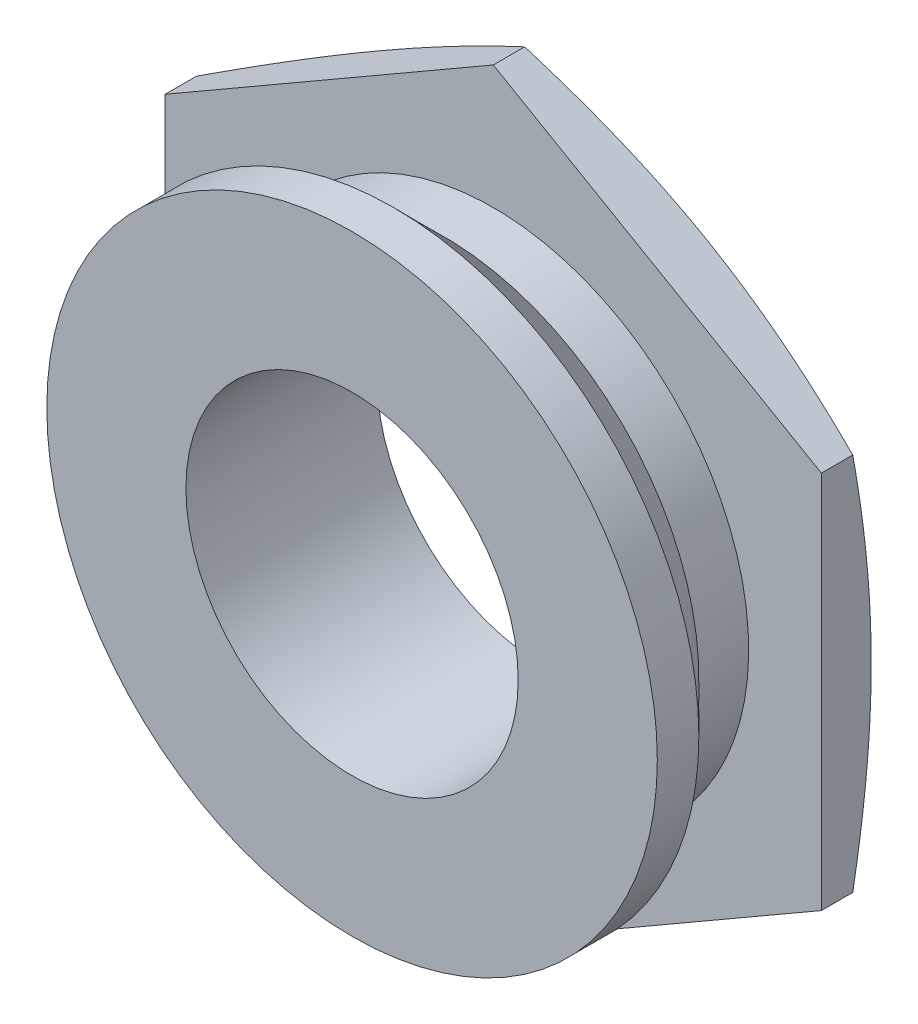
ISO-10303-21;
HEADER;
FILE_DESCRIPTION(('STEP AP214'),'2;1');
FILE_NAME('part.step','',(''),(''),'','','');
FILE_SCHEMA(('AUTOMOTIVE_DESIGN { 1 0 10303 214 1 1 1 1 }'));
ENDSEC;
DATA;
#1=APPLICATION_CONTEXT('core data for automotive mechanical design processes');
#2=APPLICATION_PROTOCOL_DEFINITION('international standard','automotive_design',2000,#1);
#3=PRODUCT_CONTEXT('',#1,'mechanical');
#4=PRODUCT('Part','Part','',(#3));
#5=PRODUCT_RELATED_PRODUCT_CATEGORY('part','',(#4));
#6=PRODUCT_DEFINITION_FORMATION('','',#4);
#7=PRODUCT_DEFINITION_CONTEXT('part definition',#1,'design');
#8=PRODUCT_DEFINITION('design','',#6,#7);
#9=PRODUCT_DEFINITION_SHAPE('','',#8);
#10=(LENGTH_UNIT() NAMED_UNIT(*) SI_UNIT(.MILLI.,.METRE.));
#11=(NAMED_UNIT(*) PLANE_ANGLE_UNIT() SI_UNIT($,.RADIAN.));
#12=(NAMED_UNIT(*) SI_UNIT($,.STERADIAN.) SOLID_ANGLE_UNIT());
#13=UNCERTAINTY_MEASURE_WITH_UNIT(LENGTH_MEASURE(1.E-05),#10,'distance_accuracy_value','');
#14=(GEOMETRIC_REPRESENTATION_CONTEXT(3) GLOBAL_UNCERTAINTY_ASSIGNED_CONTEXT((#13)) GLOBAL_UNIT_ASSIGNED_CONTEXT((#10,
#11,#12)) REPRESENTATION_CONTEXT('',''));
#15=CARTESIAN_POINT('',(0.,0.,0.));
#16=DIRECTION('',(0.,0.,1.));
#17=DIRECTION('',(1.,0.,0.));
#18=AXIS2_PLACEMENT_3D('',#15,#16,#17);
#19=CARTESIAN_POINT('',(0.,3.075,0.));
#20=DIRECTION('',(0.,0.,1.));
#21=DIRECTION('',(0.,-1.,0.));
#22=AXIS2_PLACEMENT_3D('',#19,#20,#21);
#23=PLANE('',#22);
#24=DIRECTION('',(-0.866025403784439,-0.5,0.));
#25=VECTOR('',#24,1.);
#26=CARTESIAN_POINT('',(3.95,-2.28053356329902,0.));
#27=LINE('',#26,#25);
#28=CARTESIAN_POINT('',(3.95,-2.28053356329902,0.));
#29=VERTEX_POINT('',#28);
#30=CARTESIAN_POINT('',(0.,-4.56106712659804,0.));
#31=VERTEX_POINT('',#30);
#32=EDGE_CURVE('E145',#29,#31,#27,.T.);
#33=ORIENTED_EDGE('',*,*,#32,.F.);
#34=DIRECTION('',(0.,-1.,0.));
#35=VECTOR('',#34,1.);
#36=CARTESIAN_POINT('',(3.95,2.28053356329902,0.));
#37=LINE('',#36,#35);
#38=CARTESIAN_POINT('',(3.95,2.28053356329902,0.));
#39=VERTEX_POINT('',#38);
#40=EDGE_CURVE('E137',#39,#29,#37,.T.);
#41=ORIENTED_EDGE('',*,*,#40,.F.);
#42=DIRECTION('',(0.866025403784439,-0.5,0.));
#43=VECTOR('',#42,1.);
#44=CARTESIAN_POINT('',(0.,4.56106712659804,0.));
#45=LINE('',#44,#43);
#46=CARTESIAN_POINT('',(0.,4.56106712659804,0.));
#47=VERTEX_POINT('',#46);
#48=EDGE_CURVE('E152',#47,#39,#45,.T.);
#49=ORIENTED_EDGE('',*,*,#48,.F.);
#50=DIRECTION('',(0.866025403784439,0.5,0.));
#51=VECTOR('',#50,1.);
#52=CARTESIAN_POINT('',(-3.95,2.28053356329902,0.));
#53=LINE('',#52,#51);
#54=CARTESIAN_POINT('',(-3.95,2.28053356329902,0.));
#55=VERTEX_POINT('',#54);
#56=EDGE_CURVE('E129',#55,#47,#53,.T.);
#57=ORIENTED_EDGE('',*,*,#56,.F.);
#58=DIRECTION('',(0.,1.,0.));
#59=VECTOR('',#58,1.);
#60=CARTESIAN_POINT('',(-3.95,-2.28053356329902,0.));
#61=LINE('',#60,#59);
#62=CARTESIAN_POINT('',(-3.95,-2.28053356329902,0.));
#63=VERTEX_POINT('',#62);
#64=EDGE_CURVE('E128',#63,#55,#61,.T.);
#65=ORIENTED_EDGE('',*,*,#64,.F.);
#66=DIRECTION('',(-0.866025403784439,0.5,0.));
#67=VECTOR('',#66,1.);
#68=CARTESIAN_POINT('',(0.,-4.56106712659804,0.));
#69=LINE('',#68,#67);
#70=EDGE_CURVE('E141',#31,#63,#69,.T.);
#71=ORIENTED_EDGE('',*,*,#70,.F.);
#72=EDGE_LOOP('',(#33,#41,#49,#57,#65,#71));
#73=FACE_BOUND('',#72,.T.);
#74=CARTESIAN_POINT('',(0.,0.,0.));
#75=DIRECTION('',(0.,0.,1.));
#76=DIRECTION('',(0.,-1.,0.));
#77=AXIS2_PLACEMENT_3D('',#74,#75,#76);
#78=CIRCLE('',#77,3.075);
#79=CARTESIAN_POINT('',(0.,-3.075,0.));
#80=VERTEX_POINT('',#79);
#81=EDGE_CURVE('E162',#80,#80,#78,.T.);
#82=ORIENTED_EDGE('',*,*,#81,.F.);
#83=EDGE_LOOP('',(#82));
#84=FACE_BOUND('',#83,.T.);
#85=ADVANCED_FACE('F35',(#73,#84),#23,.T.);
#86=CARTESIAN_POINT('',(0.,0.,1.7));
#87=DIRECTION('',(0.,0.,1.));
#88=DIRECTION('',(0.,-1.,0.));
#89=AXIS2_PLACEMENT_3D('',#86,#87,#88);
#90=CYLINDRICAL_SURFACE('',#89,3.075);
#91=ORIENTED_EDGE('',*,*,#81,.T.);
#92=EDGE_LOOP('',(#91));
#93=FACE_BOUND('',#92,.T.);
#94=CARTESIAN_POINT('',(0.,0.,0.600000000000001));
#95=DIRECTION('',(0.,0.,1.));
#96=DIRECTION('',(0.,-1.,0.));
#97=AXIS2_PLACEMENT_3D('',#94,#95,#96);
#98=CIRCLE('',#97,3.075);
#99=CARTESIAN_POINT('',(0.,-3.075,0.600000000000001));
#100=VERTEX_POINT('',#99);
#101=EDGE_CURVE('E160',#100,#100,#98,.T.);
#102=ORIENTED_EDGE('',*,*,#101,.F.);
#103=EDGE_LOOP('',(#102));
#104=FACE_BOUND('',#103,.T.);
#105=ADVANCED_FACE('F248',(#93,#104),#90,.T.);
#106=CARTESIAN_POINT('',(0.,0.,1.2));
#107=DIRECTION('',(0.,0.,1.));
#108=DIRECTION('',(0.,-1.,0.));
#109=AXIS2_PLACEMENT_3D('',#106,#107,#108);
#110=CONICAL_SURFACE('',#109,3.675,0.785398163397448);
#111=ORIENTED_EDGE('',*,*,#101,.T.);
#112=EDGE_LOOP('',(#111));
#113=FACE_BOUND('',#112,.T.);
#114=CARTESIAN_POINT('',(0.,0.,1.2));
#115=DIRECTION('',(0.,0.,1.));
#116=DIRECTION('',(0.,-1.,0.));
#117=AXIS2_PLACEMENT_3D('',#114,#115,#116);
#118=CIRCLE('',#117,3.675);
#119=CARTESIAN_POINT('',(0.,-3.675,1.2));
#120=VERTEX_POINT('',#119);
#121=EDGE_CURVE('E157',#120,#120,#118,.T.);
#122=ORIENTED_EDGE('',*,*,#121,.F.);
#123=EDGE_LOOP('',(#122));
#124=FACE_BOUND('',#123,.T.);
#125=ADVANCED_FACE('F253',(#113,#124),#110,.T.);
#126=CARTESIAN_POINT('',(0.,0.,1.7));
#127=DIRECTION('',(0.,0.,1.));
#128=DIRECTION('',(0.,-1.,0.));
#129=AXIS2_PLACEMENT_3D('',#126,#127,#128);
#130=CYLINDRICAL_SURFACE('',#129,3.675);
#131=ORIENTED_EDGE('',*,*,#121,.T.);
#132=EDGE_LOOP('',(#131));
#133=FACE_BOUND('',#132,.T.);
#134=CARTESIAN_POINT('',(0.,0.,1.7));
#135=DIRECTION('',(0.,0.,1.));
#136=DIRECTION('',(0.,-1.,0.));
#137=AXIS2_PLACEMENT_3D('',#134,#135,#136);
#138=CIRCLE('',#137,3.675);
#139=CARTESIAN_POINT('',(0.,-3.675,1.7));
#140=VERTEX_POINT('',#139);
#141=EDGE_CURVE('E154',#140,#140,#138,.T.);
#142=ORIENTED_EDGE('',*,*,#141,.F.);
#143=EDGE_LOOP('',(#142));
#144=FACE_BOUND('',#143,.T.);
#145=ADVANCED_FACE('F259',(#133,#144),#130,.T.);
#146=CARTESIAN_POINT('',(0.,3.675,1.7));
#147=DIRECTION('',(0.,0.,1.));
#148=DIRECTION('',(0.,-1.,0.));
#149=AXIS2_PLACEMENT_3D('',#146,#147,#148);
#150=PLANE('',#149);
#151=CARTESIAN_POINT('',(0.,0.,1.7));
#152=DIRECTION('',(0.,0.,-1.));
#153=DIRECTION('',(-1.,0.,0.));
#154=AXIS2_PLACEMENT_3D('',#151,#152,#153);
#155=CIRCLE('',#154,2.);
#156=CARTESIAN_POINT('',(-2.,0.,1.7));
#157=VERTEX_POINT('',#156);
#158=EDGE_CURVE('E288',#157,#157,#155,.T.);
#159=ORIENTED_EDGE('',*,*,#158,.T.);
#160=EDGE_LOOP('',(#159));
#161=FACE_BOUND('',#160,.T.);
#162=ORIENTED_EDGE('',*,*,#141,.T.);
#163=EDGE_LOOP('',(#162));
#164=FACE_BOUND('',#163,.T.);
#165=ADVANCED_FACE('F263',(#161,#164),#150,.T.);
#166=CARTESIAN_POINT('',(0.,4.56106712659804,12.0674493300504));
#167=DIRECTION('',(0.5,0.866025403784439,0.));
#168=DIRECTION('',(-0.866025403784439,0.5,0.));
#169=AXIS2_PLACEMENT_3D('',#166,#167,#168);
#170=PLANE('',#169);
#171=CARTESIAN_POINT('',(-0.000200000000000009,4.56118259665188,-0.377547725521246));
#172=CARTESIAN_POINT('',(0.163394645638989,4.46673118395423,-0.411939136315846));
#173=CARTESIAN_POINT('',(0.327528779089733,4.37196829782324,-0.443224156372785));
#174=CARTESIAN_POINT('',(0.656864333361271,4.18182632691085,-0.49826540675319));
#175=CARTESIAN_POINT('',(0.82206648688232,4.08644681910477,-0.522015744883351));
#176=CARTESIAN_POINT('',(1.1517045911922,3.8961301708463,-0.560431271655497));
#177=CARTESIAN_POINT('',(1.31613301273488,3.80119737740621,-0.575180255897328));
#178=CARTESIAN_POINT('',(1.64537440115126,3.61110977317565,-0.594962798298042));
#179=CARTESIAN_POINT('',(1.81018720057563,3.51595505906209,-0.599999999999999));
#180=CARTESIAN_POINT('',(2.13981279942437,3.32564563083498,-0.599999999999999));
#181=CARTESIAN_POINT('',(2.30462559884874,3.23049091672142,-0.594962798298042));
#182=CARTESIAN_POINT('',(2.63386698726512,3.04040331249086,-0.575180255897328));
#183=CARTESIAN_POINT('',(2.7982954088078,2.94547051905077,-0.560431271655497));
#184=CARTESIAN_POINT('',(3.12793351311768,2.7551538707923,-0.522015744883351));
#185=CARTESIAN_POINT('',(3.29313566663873,2.65977436298622,-0.49826540675319));
#186=CARTESIAN_POINT('',(3.62247122091027,2.46963239207383,-0.443224156372785));
#187=CARTESIAN_POINT('',(3.78660535436101,2.37486950594284,-0.411939136315846));
#188=CARTESIAN_POINT('',(3.9502,2.28041809324519,-0.377547725521245));
#189=B_SPLINE_CURVE_WITH_KNOTS('',3,(#171,#172,#173,#174,#175,#176,#177,#178,#179,#180,#181,
#182,#183,#184,#185,#186,#187,#188),.UNSPECIFIED.,.F.,.F.,(4,2,2,2,2,2,2,2,4),(0.,
0.576083228362151,1.15261585512616,1.72369611610119,2.29456208472354,2.86542805334588,
3.43650831432091,4.01304094108492,4.58912416944707),.UNSPECIFIED.);
#190=CARTESIAN_POINT('',(0.,4.56106712659804,-0.377589754779738));
#191=VERTEX_POINT('',#190);
#192=CARTESIAN_POINT('',(1.975,3.42080034494853,-0.599999999999999));
#193=VERTEX_POINT('',#192);
#194=EDGE_CURVE('E279',#191,#193,#189,.T.);
#195=ORIENTED_EDGE('',*,*,#194,.F.);
#196=DIRECTION('',(0.,0.,-1.));
#197=VECTOR('',#196,1.);
#198=CARTESIAN_POINT('',(0.,4.56106712659804,12.0674493300504));
#199=LINE('',#198,#197);
#200=EDGE_CURVE('E131',#47,#191,#199,.T.);
#201=ORIENTED_EDGE('',*,*,#200,.F.);
#202=ORIENTED_EDGE('',*,*,#48,.T.);
#203=DIRECTION('',(0.,0.,-1.));
#204=VECTOR('',#203,1.);
#205=CARTESIAN_POINT('',(3.95,2.28053356329902,12.0674493300504));
#206=LINE('',#205,#204);
#207=CARTESIAN_POINT('',(3.95,2.28053356329903,-0.377589754779738));
#208=VERTEX_POINT('',#207);
#209=EDGE_CURVE('E149',#39,#208,#206,.T.);
#210=ORIENTED_EDGE('',*,*,#209,.T.);
#211=EDGE_CURVE('E273',#193,#208,#189,.T.);
#212=ORIENTED_EDGE('',*,*,#211,.F.);
#213=EDGE_LOOP('',(#195,#201,#202,#210,#212));
#214=FACE_BOUND('',#213,.T.);
#215=ADVANCED_FACE('F267',(#214),#170,.T.);
#216=CARTESIAN_POINT('',(3.95,2.28053356329902,12.0674493300504));
#217=DIRECTION('',(1.,0.,0.));
#218=DIRECTION('',(0.,1.,0.));
#219=AXIS2_PLACEMENT_3D('',#216,#217,#218);
#220=PLANE('',#219);
#221=CARTESIAN_POINT('',(3.95,-6.03805098489355,0.588472147348961));
#222=CARTESIAN_POINT('',(3.95,-5.85933869988011,0.534054324238001));
#223=CARTESIAN_POINT('',(3.95,-5.68042946739473,0.480271486300747));
#224=CARTESIAN_POINT('',(3.95,-5.32211684037161,0.374327053579596));
#225=CARTESIAN_POINT('',(3.95,-5.14271340794712,0.322165587085427));
#226=CARTESIAN_POINT('',(3.95,-4.78300504576268,0.219728399957085));
#227=CARTESIAN_POINT('',(3.95,-4.60269905854142,0.169456379229714));
#228=CARTESIAN_POINT('',(3.95,-4.241416366318,0.0713866322203015));
#229=CARTESIAN_POINT('',(3.95,-4.06043967342107,0.0235888615125296));
#230=CARTESIAN_POINT('',(3.95,-3.6999267765105,-0.0683504780592834));
#231=CARTESIAN_POINT('',(3.95,-3.52040024784364,-0.112529797910796));
#232=CARTESIAN_POINT('',(3.95,-3.16046294750332,-0.197124832577449));
#233=CARTESIAN_POINT('',(3.95,-2.98005220600987,-0.237540674919057));
#234=CARTESIAN_POINT('',(3.95,-2.618292490451,-0.313670032421782));
#235=CARTESIAN_POINT('',(3.95,-2.43694383168832,-0.349385033065053));
#236=CARTESIAN_POINT('',(3.95,-2.07319366031589,-0.41502399378753));
#237=CARTESIAN_POINT('',(3.95,-1.8907921831926,-0.444948147893586));
#238=CARTESIAN_POINT('',(3.95,-1.54547102153879,-0.494827468355308));
#239=CARTESIAN_POINT('',(3.95,-1.38265944413584,-0.515524101436541));
#240=CARTESIAN_POINT('',(3.95,-1.05635681627977,-0.550557384538961));
#241=CARTESIAN_POINT('',(3.95,-0.892865824206534,-0.564894570049616));
#242=CARTESIAN_POINT('',(3.95,-0.565522552709325,-0.586520515381504));
#243=CARTESIAN_POINT('',(3.95,-0.401670595034491,-0.59381406722805));
#244=CARTESIAN_POINT('',(3.95,-0.0738027609892456,-0.600982758327267));
#245=CARTESIAN_POINT('',(3.95,0.0902131142154053,-0.600857949968151));
#246=CARTESIAN_POINT('',(3.95,0.418900194710524,-0.593177383146434));
#247=CARTESIAN_POINT('',(3.95,0.583570504989359,-0.58558394174616));
#248=CARTESIAN_POINT('',(3.95,0.912427289391331,-0.56331515250934));
#249=CARTESIAN_POINT('',(3.95,1.07661375179499,-0.548639634530531));
#250=CARTESIAN_POINT('',(3.95,1.40442251762932,-0.512894731475785));
#251=CARTESIAN_POINT('',(3.95,1.56804421392796,-0.491819854594111));
#252=CARTESIAN_POINT('',(3.95,1.89446683958625,-0.444125383334469));
#253=CARTESIAN_POINT('',(3.95,2.05726776454209,-0.417505759238778));
#254=CARTESIAN_POINT('',(3.95,2.56158688558696,-0.327601137632812));
#255=CARTESIAN_POINT('',(3.95,2.90167554809464,-0.256319814583836));
#256=CARTESIAN_POINT('',(3.95,3.57869455397605,-0.100038633266692));
#257=CARTESIAN_POINT('',(3.95,3.91562371337153,-0.0150338338869124));
#258=CARTESIAN_POINT('',(3.95,4.58748518776409,0.164121164065658));
#259=CARTESIAN_POINT('',(3.95,4.92241435502613,0.258283053367429));
#260=CARTESIAN_POINT('',(3.95,5.59043474624669,0.452664416491018));
#261=CARTESIAN_POINT('',(3.95,5.92352625272211,0.552882929166195));
#262=CARTESIAN_POINT('',(3.95,6.58474397814754,0.756381777672387));
#263=CARTESIAN_POINT('',(3.95,6.91288442125019,0.859616107453526));
#264=CARTESIAN_POINT('',(3.95,7.56824257244402,1.06901711954946));
#265=CARTESIAN_POINT('',(3.95,7.89546023543049,1.17518394255509));
#266=CARTESIAN_POINT('',(3.95,8.54795230850632,1.38924813731862));
#267=CARTESIAN_POINT('',(3.95,8.87322938099829,1.497137414293));
#268=CARTESIAN_POINT('',(3.95,9.52321317990156,1.71453359512624));
#269=CARTESIAN_POINT('',(3.95,9.84791995108263,1.82404036501767));
#270=CARTESIAN_POINT('',(3.95,10.17243201379,1.93411301839285));
#271=B_SPLINE_CURVE_WITH_KNOTS('',3,(#221,#222,#223,#224,#225,#226,#227,#228,#229,#230,#231,
#232,#233,#234,#235,#236,#237,#238,#239,#240,#241,#242,#243,#244,#245,#246,#247,#248,#249,#250,
#251,#252,#253,#254,#255,#256,#257,#258,#259,#260,#261,#262,#263,#264,#265,#266,#267,#268,#269,
#270),.UNSPECIFIED.,.F.,.F.,(4,2,2,2,2,2,2,2,2,2,2,2,2,2,2,2,2,2,2,2,2,2,2,2,4),(0.,
0.560445245275148,1.12093472303445,1.68246993435923,2.2439950596901,2.79861092882412,
3.35320799780336,3.90762938927133,4.46203220119863,4.95428945287775,5.44650524676761,
5.93838593298634,6.43026314556039,6.92463491899961,7.41901856998896,7.91382769631081,
8.40863947468853,9.45056815185454,10.4928728135512,11.5365260910689,12.5800141803173,
13.6119843907916,14.6440041979027,15.6721081678377,16.7001274581947),.UNSPECIFIED.);
#272=CARTESIAN_POINT('',(3.95,0.,-0.599999999999999));
#273=VERTEX_POINT('',#272);
#274=EDGE_CURVE('E280',#208,#273,#271,.F.);
#275=ORIENTED_EDGE('',*,*,#274,.F.);
#276=ORIENTED_EDGE('',*,*,#209,.F.);
#277=ORIENTED_EDGE('',*,*,#40,.T.);
#278=DIRECTION('',(0.,0.,-1.));
#279=VECTOR('',#278,1.);
#280=CARTESIAN_POINT('',(3.95,-2.28053356329902,12.0674493300504));
#281=LINE('',#280,#279);
#282=CARTESIAN_POINT('',(3.95,-2.28053356329902,-0.377589754779738));
#283=VERTEX_POINT('',#282);
#284=EDGE_CURVE('E146',#29,#283,#281,.T.);
#285=ORIENTED_EDGE('',*,*,#284,.T.);
#286=EDGE_CURVE('E192',#273,#283,#271,.F.);
#287=ORIENTED_EDGE('',*,*,#286,.F.);
#288=EDGE_LOOP('',(#275,#276,#277,#285,#287));
#289=FACE_BOUND('',#288,.T.);
#290=ADVANCED_FACE('F246',(#289),#220,.T.);
#291=CARTESIAN_POINT('',(3.95,-2.28053356329902,12.0674493300504));
#292=DIRECTION('',(0.5,-0.866025403784439,0.));
#293=DIRECTION('',(0.866025403784439,0.5,0.));
#294=AXIS2_PLACEMENT_3D('',#291,#292,#293);
#295=PLANE('',#294);
#296=CARTESIAN_POINT('',(3.9502,-2.28041809324518,-0.377547725521246));
#297=CARTESIAN_POINT('',(3.78660535436101,-2.37486950594283,-0.411939136315845));
#298=CARTESIAN_POINT('',(3.62247122091027,-2.46963239207383,-0.443224156372785));
#299=CARTESIAN_POINT('',(3.29313566663873,-2.65977436298621,-0.49826540675319));
#300=CARTESIAN_POINT('',(3.12793351311768,-2.7551538707923,-0.522015744883352));
#301=CARTESIAN_POINT('',(2.7982954088078,-2.94547051905076,-0.560431271655497));
#302=CARTESIAN_POINT('',(2.63386698726512,-3.04040331249086,-0.575180255897328));
#303=CARTESIAN_POINT('',(2.30462559884874,-3.23049091672142,-0.594962798298042));
#304=CARTESIAN_POINT('',(2.13981279942437,-3.32564563083497,-0.6));
#305=CARTESIAN_POINT('',(1.81018720057563,-3.51595505906209,-0.6));
#306=CARTESIAN_POINT('',(1.64537440115126,-3.61110977317564,-0.594962798298043));
#307=CARTESIAN_POINT('',(1.31613301273488,-3.8011973774062,-0.575180255897329));
#308=CARTESIAN_POINT('',(1.1517045911922,-3.8961301708463,-0.560431271655498));
#309=CARTESIAN_POINT('',(0.822066486882319,-4.08644681910476,-0.522015744883352));
#310=CARTESIAN_POINT('',(0.65686433336127,-4.18182632691085,-0.498265406753191));
#311=CARTESIAN_POINT('',(0.327528779089732,-4.37196829782323,-0.443224156372786));
#312=CARTESIAN_POINT('',(0.163394645638988,-4.46673118395423,-0.411939136315846));
#313=CARTESIAN_POINT('',(-0.000200000000000613,-4.56118259665188,-0.377547725521247));
#314=B_SPLINE_CURVE_WITH_KNOTS('',3,(#296,#297,#298,#299,#300,#301,#302,#303,#304,#305,#306,
#307,#308,#309,#310,#311,#312,#313),.UNSPECIFIED.,.F.,.F.,(4,2,2,2,2,2,2,2,4),(0.,
0.576083228362151,1.15261585512617,1.72369611610119,2.29456208472354,2.86542805334588,
3.43650831432091,4.01304094108492,4.58912416944708),.UNSPECIFIED.);
#315=CARTESIAN_POINT('',(1.975,-3.42080034494853,-0.599999999999999));
#316=VERTEX_POINT('',#315);
#317=EDGE_CURVE('E188',#283,#316,#314,.T.);
#318=ORIENTED_EDGE('',*,*,#317,.F.);
#319=ORIENTED_EDGE('',*,*,#284,.F.);
#320=ORIENTED_EDGE('',*,*,#32,.T.);
#321=DIRECTION('',(0.,0.,-1.));
#322=VECTOR('',#321,1.);
#323=CARTESIAN_POINT('',(0.,-4.56106712659804,12.0674493300504));
#324=LINE('',#323,#322);
#325=CARTESIAN_POINT('',(0.,-4.56106712659804,-0.377589754779738));
#326=VERTEX_POINT('',#325);
#327=EDGE_CURVE('E142',#31,#326,#324,.T.);
#328=ORIENTED_EDGE('',*,*,#327,.T.);
#329=EDGE_CURVE('E180',#316,#326,#314,.T.);
#330=ORIENTED_EDGE('',*,*,#329,.F.);
#331=EDGE_LOOP('',(#318,#319,#320,#328,#330));
#332=FACE_BOUND('',#331,.T.);
#333=ADVANCED_FACE('F186',(#332),#295,.T.);
#334=CARTESIAN_POINT('',(0.,-4.56106712659804,12.0674493300504));
#335=DIRECTION('',(-0.5,-0.866025403784438,0.));
#336=DIRECTION('',(0.866025403784439,-0.5,0.));
#337=AXIS2_PLACEMENT_3D('',#334,#335,#336);
#338=PLANE('',#337);
#339=CARTESIAN_POINT('',(0.000199999999998326,-4.56118259665188,-0.377547725521246));
#340=CARTESIAN_POINT('',(-0.163394645638991,-4.46673118395423,-0.411939136315846));
#341=CARTESIAN_POINT('',(-0.327528779089735,-4.37196829782324,-0.443224156372786));
#342=CARTESIAN_POINT('',(-0.656864333361272,-4.18182632691085,-0.49826540675319));
#343=CARTESIAN_POINT('',(-0.822066486882321,-4.08644681910477,-0.522015744883352));
#344=CARTESIAN_POINT('',(-1.1517045911922,-3.8961301708463,-0.560431271655497));
#345=CARTESIAN_POINT('',(-1.31613301273488,-3.80119737740621,-0.575180255897328));
#346=CARTESIAN_POINT('',(-1.64537440115126,-3.61110977317565,-0.594962798298042));
#347=CARTESIAN_POINT('',(-1.81018720057563,-3.51595505906209,-0.599999999999999));
#348=CARTESIAN_POINT('',(-2.13981279942437,-3.32564563083497,-0.599999999999999));
#349=CARTESIAN_POINT('',(-2.30462559884875,-3.23049091672142,-0.594962798298042));
#350=CARTESIAN_POINT('',(-2.63386698726512,-3.04040331249086,-0.575180255897328));
#351=CARTESIAN_POINT('',(-2.7982954088078,-2.94547051905076,-0.560431271655497));
#352=CARTESIAN_POINT('',(-3.12793351311768,-2.7551538707923,-0.522015744883352));
#353=CARTESIAN_POINT('',(-3.29313566663873,-2.65977436298621,-0.49826540675319));
#354=CARTESIAN_POINT('',(-3.62247122091027,-2.46963239207383,-0.443224156372785));
#355=CARTESIAN_POINT('',(-3.78660535436101,-2.37486950594283,-0.411939136315846));
#356=CARTESIAN_POINT('',(-3.9502,-2.28041809324518,-0.377547725521246));
#357=B_SPLINE_CURVE_WITH_KNOTS('',3,(#339,#340,#341,#342,#343,#344,#345,#346,#347,#348,#349,
#350,#351,#352,#353,#354,#355,#356),.UNSPECIFIED.,.F.,.F.,(4,2,2,2,2,2,2,2,4),(0.,
0.576083228362151,1.15261585512616,1.72369611610119,2.29456208472354,2.86542805334588,
3.43650831432091,4.01304094108492,4.58912416944707),.UNSPECIFIED.);
#358=CARTESIAN_POINT('',(-1.975,-3.42080034494853,-0.599999999999999));
#359=VERTEX_POINT('',#358);
#360=EDGE_CURVE('E58',#326,#359,#357,.T.);
#361=ORIENTED_EDGE('',*,*,#360,.F.);
#362=ORIENTED_EDGE('',*,*,#327,.F.);
#363=ORIENTED_EDGE('',*,*,#70,.T.);
#364=DIRECTION('',(0.,0.,-1.));
#365=VECTOR('',#364,1.);
#366=CARTESIAN_POINT('',(-3.95,-2.28053356329902,12.0674493300504));
#367=LINE('',#366,#365);
#368=CARTESIAN_POINT('',(-3.95,-2.28053356329903,-0.377589754779738));
#369=VERTEX_POINT('',#368);
#370=EDGE_CURVE('E133',#63,#369,#367,.T.);
#371=ORIENTED_EDGE('',*,*,#370,.T.);
#372=EDGE_CURVE('E193',#359,#369,#357,.T.);
#373=ORIENTED_EDGE('',*,*,#372,.F.);
#374=EDGE_LOOP('',(#361,#362,#363,#371,#373));
#375=FACE_BOUND('',#374,.T.);
#376=ADVANCED_FACE('F239',(#375),#338,.T.);
#377=CARTESIAN_POINT('',(-3.95,-2.28053356329902,12.0674493300504));
#378=DIRECTION('',(-1.,0.,0.));
#379=DIRECTION('',(0.,0.,1.));
#380=AXIS2_PLACEMENT_3D('',#377,#378,#379);
#381=PLANE('',#380);
#382=CARTESIAN_POINT('',(-3.95,-6.03805098489355,0.58847214734896));
#383=CARTESIAN_POINT('',(-3.95,-5.85933869988011,0.534054324238));
#384=CARTESIAN_POINT('',(-3.95,-5.68042946739473,0.480271486300745));
#385=CARTESIAN_POINT('',(-3.95,-5.3221168403716,0.374327053579595));
#386=CARTESIAN_POINT('',(-3.95,-5.14271340794712,0.322165587085426));
#387=CARTESIAN_POINT('',(-3.95,-4.78300504576267,0.219728399957084));
#388=CARTESIAN_POINT('',(-3.95,-4.60269905854142,0.169456379229713));
#389=CARTESIAN_POINT('',(-3.95,-4.24141636631799,0.0713866322203001));
#390=CARTESIAN_POINT('',(-3.95,-4.06043967342107,0.0235888615125284));
#391=CARTESIAN_POINT('',(-3.95,-3.6999267765105,-0.0683504780592844));
#392=CARTESIAN_POINT('',(-3.95,-3.52040024784364,-0.112529797910797));
#393=CARTESIAN_POINT('',(-3.95,-3.16046294750331,-0.19712483257745));
#394=CARTESIAN_POINT('',(-3.95,-2.98005220600987,-0.237540674919057));
#395=CARTESIAN_POINT('',(-3.95,-2.618292490451,-0.313670032421782));
#396=CARTESIAN_POINT('',(-3.95,-2.43694383168832,-0.349385033065054));
#397=CARTESIAN_POINT('',(-3.95,-2.07319366031589,-0.415023993787531));
#398=CARTESIAN_POINT('',(-3.95,-1.8907921831926,-0.444948147893587));
#399=CARTESIAN_POINT('',(-3.95,-1.54547102153879,-0.494827468355308));
#400=CARTESIAN_POINT('',(-3.95,-1.38265944413584,-0.515524101436541));
#401=CARTESIAN_POINT('',(-3.95,-1.05635681627977,-0.550557384538961));
#402=CARTESIAN_POINT('',(-3.95,-0.892865824206535,-0.564894570049616));
#403=CARTESIAN_POINT('',(-3.95,-0.565522552709326,-0.586520515381504));
#404=CARTESIAN_POINT('',(-3.95,-0.401670595034492,-0.593814067228051));
#405=CARTESIAN_POINT('',(-3.95,-0.0738027609892468,-0.600982758327267));
#406=CARTESIAN_POINT('',(-3.95,0.0902131142154041,-0.600857949968151));
#407=CARTESIAN_POINT('',(-3.95,0.418900194710523,-0.593177383146434));
#408=CARTESIAN_POINT('',(-3.95,0.583570504989358,-0.58558394174616));
#409=CARTESIAN_POINT('',(-3.95,0.91242728939133,-0.56331515250934));
#410=CARTESIAN_POINT('',(-3.95,1.07661375179499,-0.548639634530531));
#411=CARTESIAN_POINT('',(-3.95,1.40442251762932,-0.512894731475785));
#412=CARTESIAN_POINT('',(-3.95,1.56804421392796,-0.491819854594111));
#413=CARTESIAN_POINT('',(-3.95,1.89446683958625,-0.444125383334469));
#414=CARTESIAN_POINT('',(-3.95,2.05726776454209,-0.417505759238778));
#415=CARTESIAN_POINT('',(-3.95,2.56158688558696,-0.327601137632812));
#416=CARTESIAN_POINT('',(-3.95,2.90167554809464,-0.256319814583836));
#417=CARTESIAN_POINT('',(-3.95,3.57869455397605,-0.100038633266692));
#418=CARTESIAN_POINT('',(-3.95,3.91562371337153,-0.0150338338869116));
#419=CARTESIAN_POINT('',(-3.95,4.58748518776409,0.164121164065659));
#420=CARTESIAN_POINT('',(-3.95,4.92241435502614,0.25828305336743));
#421=CARTESIAN_POINT('',(-3.95,5.5904347462467,0.452664416491019));
#422=CARTESIAN_POINT('',(-3.95,5.92352625272211,0.552882929166197));
#423=CARTESIAN_POINT('',(-3.95,6.58474397814754,0.756381777672389));
#424=CARTESIAN_POINT('',(-3.95,6.91288442125019,0.859616107453528));
#425=CARTESIAN_POINT('',(-3.95,7.56824257244403,1.06901711954946));
#426=CARTESIAN_POINT('',(-3.95,7.8954602354305,1.17518394255509));
#427=CARTESIAN_POINT('',(-3.95,8.54795230850633,1.38924813731863));
#428=CARTESIAN_POINT('',(-3.95,8.8732293809983,1.497137414293));
#429=CARTESIAN_POINT('',(-3.95,9.52321317990157,1.71453359512624));
#430=CARTESIAN_POINT('',(-3.95,9.84791995108264,1.82404036501767));
#431=CARTESIAN_POINT('',(-3.95,10.17243201379,1.93411301839285));
#432=B_SPLINE_CURVE_WITH_KNOTS('',3,(#382,#383,#384,#385,#386,#387,#388,#389,#390,#391,#392,
#393,#394,#395,#396,#397,#398,#399,#400,#401,#402,#403,#404,#405,#406,#407,#408,#409,#410,#411,
#412,#413,#414,#415,#416,#417,#418,#419,#420,#421,#422,#423,#424,#425,#426,#427,#428,#429,#430,
#431),.UNSPECIFIED.,.F.,.F.,(4,2,2,2,2,2,2,2,2,2,2,2,2,2,2,2,2,2,2,2,2,2,2,2,4),(0.,
0.560445245275149,1.12093472303445,1.68246993435923,2.2439950596901,2.79861092882412,
3.35320799780336,3.90762938927133,4.46203220119863,4.95428945287775,5.44650524676761,
5.93838593298634,6.43026314556039,6.92463491899961,7.41901856998896,7.9138276963108,
8.40863947468853,9.45056815185454,10.4928728135512,11.5365260910689,12.5800141803173,
13.6119843907916,14.6440041979027,15.6721081678377,16.7001274581947),.UNSPECIFIED.);
#433=CARTESIAN_POINT('',(-3.95,0.,-0.599999999999999));
#434=VERTEX_POINT('',#433);
#435=EDGE_CURVE('E50',#369,#434,#432,.T.);
#436=ORIENTED_EDGE('',*,*,#435,.F.);
#437=ORIENTED_EDGE('',*,*,#370,.F.);
#438=ORIENTED_EDGE('',*,*,#64,.T.);
#439=DIRECTION('',(0.,0.,-1.));
#440=VECTOR('',#439,1.);
#441=CARTESIAN_POINT('',(-3.95,2.28053356329902,12.0674493300504));
#442=LINE('',#441,#440);
#443=CARTESIAN_POINT('',(-3.95,2.28053356329902,-0.377589754779738));
#444=VERTEX_POINT('',#443);
#445=EDGE_CURVE('E121',#55,#444,#442,.T.);
#446=ORIENTED_EDGE('',*,*,#445,.T.);
#447=EDGE_CURVE('E107',#434,#444,#432,.T.);
#448=ORIENTED_EDGE('',*,*,#447,.F.);
#449=EDGE_LOOP('',(#436,#437,#438,#446,#448));
#450=FACE_BOUND('',#449,.T.);
#451=ADVANCED_FACE('F126',(#450),#381,.T.);
#452=CARTESIAN_POINT('',(-3.95,2.28053356329902,12.0674493300504));
#453=DIRECTION('',(-0.5,0.866025403784439,0.));
#454=DIRECTION('',(-0.866025403784439,-0.5,0.));
#455=AXIS2_PLACEMENT_3D('',#452,#453,#454);
#456=PLANE('',#455);
#457=CARTESIAN_POINT('',(-3.9502,2.28041809324519,-0.377547725521245));
#458=CARTESIAN_POINT('',(-3.78660535436101,2.37486950594284,-0.411939136315845));
#459=CARTESIAN_POINT('',(-3.62247122091027,2.46963239207383,-0.443224156372784));
#460=CARTESIAN_POINT('',(-3.29313566663873,2.65977436298622,-0.49826540675319));
#461=CARTESIAN_POINT('',(-3.12793351311768,2.7551538707923,-0.522015744883351));
#462=CARTESIAN_POINT('',(-2.7982954088078,2.94547051905077,-0.560431271655497));
#463=CARTESIAN_POINT('',(-2.63386698726512,3.04040331249086,-0.575180255897328));
#464=CARTESIAN_POINT('',(-2.30462559884874,3.23049091672142,-0.594962798298041));
#465=CARTESIAN_POINT('',(-2.13981279942437,3.32564563083498,-0.599999999999999));
#466=CARTESIAN_POINT('',(-1.81018720057563,3.51595505906209,-0.599999999999999));
#467=CARTESIAN_POINT('',(-1.64537440115125,3.61110977317565,-0.594962798298041));
#468=CARTESIAN_POINT('',(-1.31613301273488,3.80119737740621,-0.575180255897328));
#469=CARTESIAN_POINT('',(-1.1517045911922,3.8961301708463,-0.560431271655497));
#470=CARTESIAN_POINT('',(-0.822066486882319,4.08644681910477,-0.522015744883351));
#471=CARTESIAN_POINT('',(-0.65686433336127,4.18182632691085,-0.49826540675319));
#472=CARTESIAN_POINT('',(-0.327528779089733,4.37196829782324,-0.443224156372785));
#473=CARTESIAN_POINT('',(-0.163394645638988,4.46673118395423,-0.411939136315845));
#474=CARTESIAN_POINT('',(0.00020000000000066,4.56118259665188,-0.377547725521245));
#475=B_SPLINE_CURVE_WITH_KNOTS('',3,(#457,#458,#459,#460,#461,#462,#463,#464,#465,#466,#467,
#468,#469,#470,#471,#472,#473,#474),.UNSPECIFIED.,.F.,.F.,(4,2,2,2,2,2,2,2,4),(0.,
0.576083228362151,1.15261585512616,1.72369611610119,2.29456208472354,2.86542805334588,
3.43650831432091,4.01304094108492,4.58912416944707),.UNSPECIFIED.);
#476=CARTESIAN_POINT('',(-1.975,3.42080034494853,-0.6));
#477=VERTEX_POINT('',#476);
#478=EDGE_CURVE('E110',#444,#477,#475,.T.);
#479=ORIENTED_EDGE('',*,*,#478,.F.);
#480=ORIENTED_EDGE('',*,*,#445,.F.);
#481=ORIENTED_EDGE('',*,*,#56,.T.);
#482=ORIENTED_EDGE('',*,*,#200,.T.);
#483=EDGE_CURVE('E123',#477,#191,#475,.T.);
#484=ORIENTED_EDGE('',*,*,#483,.F.);
#485=EDGE_LOOP('',(#479,#480,#481,#482,#484));
#486=FACE_BOUND('',#485,.T.);
#487=ADVANCED_FACE('F119',(#486),#456,.T.);
#488=CARTESIAN_POINT('',(0.,0.,-0.377589754779738));
#489=DIRECTION('',(0.,0.,1.));
#490=DIRECTION('',(1.,0.,0.));
#491=AXIS2_PLACEMENT_3D('',#488,#489,#490);
#492=CONICAL_SURFACE('',#491,4.56106712659804,1.22173047639604);
#493=ORIENTED_EDGE('',*,*,#194,.T.);
#494=CARTESIAN_POINT('',(0.,0.,-0.599999999999999));
#495=DIRECTION('',(0.,0.,-1.));
#496=DIRECTION('',(0.,1.,0.));
#497=AXIS2_PLACEMENT_3D('',#494,#495,#496);
#498=CIRCLE('',#497,3.95);
#499=EDGE_CURVE('E39',#193,#477,#498,.F.);
#500=ORIENTED_EDGE('',*,*,#499,.T.);
#501=ORIENTED_EDGE('',*,*,#483,.T.);
#502=EDGE_LOOP('',(#493,#500,#501));
#503=FACE_BOUND('',#502,.T.);
#504=ADVANCED_FACE('F219',(#503),#492,.T.);
#505=ORIENTED_EDGE('',*,*,#211,.T.);
#506=ORIENTED_EDGE('',*,*,#274,.T.);
#507=EDGE_CURVE('E167',#273,#193,#498,.F.);
#508=ORIENTED_EDGE('',*,*,#507,.T.);
#509=EDGE_LOOP('',(#505,#506,#508));
#510=FACE_BOUND('',#509,.T.);
#511=ADVANCED_FACE('F336',(#510),#492,.T.);
#512=ORIENTED_EDGE('',*,*,#286,.T.);
#513=ORIENTED_EDGE('',*,*,#317,.T.);
#514=EDGE_CURVE('E171',#316,#273,#498,.F.);
#515=ORIENTED_EDGE('',*,*,#514,.T.);
#516=EDGE_LOOP('',(#512,#513,#515));
#517=FACE_BOUND('',#516,.T.);
#518=ADVANCED_FACE('F329',(#517),#492,.T.);
#519=ORIENTED_EDGE('',*,*,#329,.T.);
#520=ORIENTED_EDGE('',*,*,#360,.T.);
#521=EDGE_CURVE('E44',#359,#316,#498,.F.);
#522=ORIENTED_EDGE('',*,*,#521,.T.);
#523=EDGE_LOOP('',(#519,#520,#522));
#524=FACE_BOUND('',#523,.T.);
#525=ADVANCED_FACE('F178',(#524),#492,.T.);
#526=ORIENTED_EDGE('',*,*,#372,.T.);
#527=ORIENTED_EDGE('',*,*,#435,.T.);
#528=EDGE_CURVE('E11',#434,#359,#498,.F.);
#529=ORIENTED_EDGE('',*,*,#528,.T.);
#530=EDGE_LOOP('',(#526,#527,#529));
#531=FACE_BOUND('',#530,.T.);
#532=ADVANCED_FACE('F218',(#531),#492,.T.);
#533=ORIENTED_EDGE('',*,*,#447,.T.);
#534=ORIENTED_EDGE('',*,*,#478,.T.);
#535=CARTESIAN_POINT('',(0.,0.,-0.599999999999999));
#536=DIRECTION('',(0.,0.,-1.));
#537=DIRECTION('',(-1.,0.,0.));
#538=AXIS2_PLACEMENT_3D('',#535,#536,#537);
#539=CIRCLE('',#538,3.95);
#540=EDGE_CURVE('E112',#434,#477,#539,.T.);
#541=ORIENTED_EDGE('',*,*,#540,.F.);
#542=EDGE_LOOP('',(#533,#534,#541));
#543=FACE_BOUND('',#542,.T.);
#544=ADVANCED_FACE('F109',(#543),#492,.T.);
#545=CARTESIAN_POINT('',(0.,3.95,-0.6));
#546=DIRECTION('',(0.,0.,-1.));
#547=DIRECTION('',(0.,1.,0.));
#548=AXIS2_PLACEMENT_3D('',#545,#546,#547);
#549=PLANE('',#548);
#550=CARTESIAN_POINT('',(0.,0.,-0.6));
#551=DIRECTION('',(0.,0.,-1.));
#552=DIRECTION('',(-1.,0.,0.));
#553=AXIS2_PLACEMENT_3D('',#550,#551,#552);
#554=CIRCLE('',#553,2.);
#555=CARTESIAN_POINT('',(-2.,0.,-0.6));
#556=VERTEX_POINT('',#555);
#557=EDGE_CURVE('E286',#556,#556,#554,.T.);
#558=ORIENTED_EDGE('',*,*,#557,.F.);
#559=EDGE_LOOP('',(#558));
#560=FACE_BOUND('',#559,.T.);
#561=ORIENTED_EDGE('',*,*,#540,.T.);
#562=ORIENTED_EDGE('',*,*,#499,.F.);
#563=ORIENTED_EDGE('',*,*,#507,.F.);
#564=ORIENTED_EDGE('',*,*,#514,.F.);
#565=ORIENTED_EDGE('',*,*,#521,.F.);
#566=ORIENTED_EDGE('',*,*,#528,.F.);
#567=EDGE_LOOP('',(#561,#562,#563,#564,#565,#566));
#568=FACE_BOUND('',#567,.T.);
#569=ADVANCED_FACE('F37',(#560,#568),#549,.T.);
#570=CARTESIAN_POINT('',(0.,0.,-0.599999999999999));
#571=DIRECTION('',(0.,0.,-1.));
#572=DIRECTION('',(-1.,0.,0.));
#573=AXIS2_PLACEMENT_3D('',#570,#571,#572);
#574=CYLINDRICAL_SURFACE('',#573,2.);
#575=ORIENTED_EDGE('',*,*,#158,.F.);
#576=EDGE_LOOP('',(#575));
#577=FACE_BOUND('',#576,.T.);
#578=ORIENTED_EDGE('',*,*,#557,.T.);
#579=EDGE_LOOP('',(#578));
#580=FACE_BOUND('',#579,.T.);
#581=ADVANCED_FACE('F220',(#577,#580),#574,.F.);
#582=CLOSED_SHELL('',(#85,#105,#125,#145,#165,#215,#290,#333,#376,#451,#487,#504,#511,#518,#525,
#532,#544,#569,#581));
#583=MANIFOLD_SOLID_BREP('B2',#582);
#584=ADVANCED_BREP_SHAPE_REPRESENTATION('',(#18,#583),#14);
#585=SHAPE_DEFINITION_REPRESENTATION(#9,#584);
ENDSEC;
END-ISO-10303-21;
